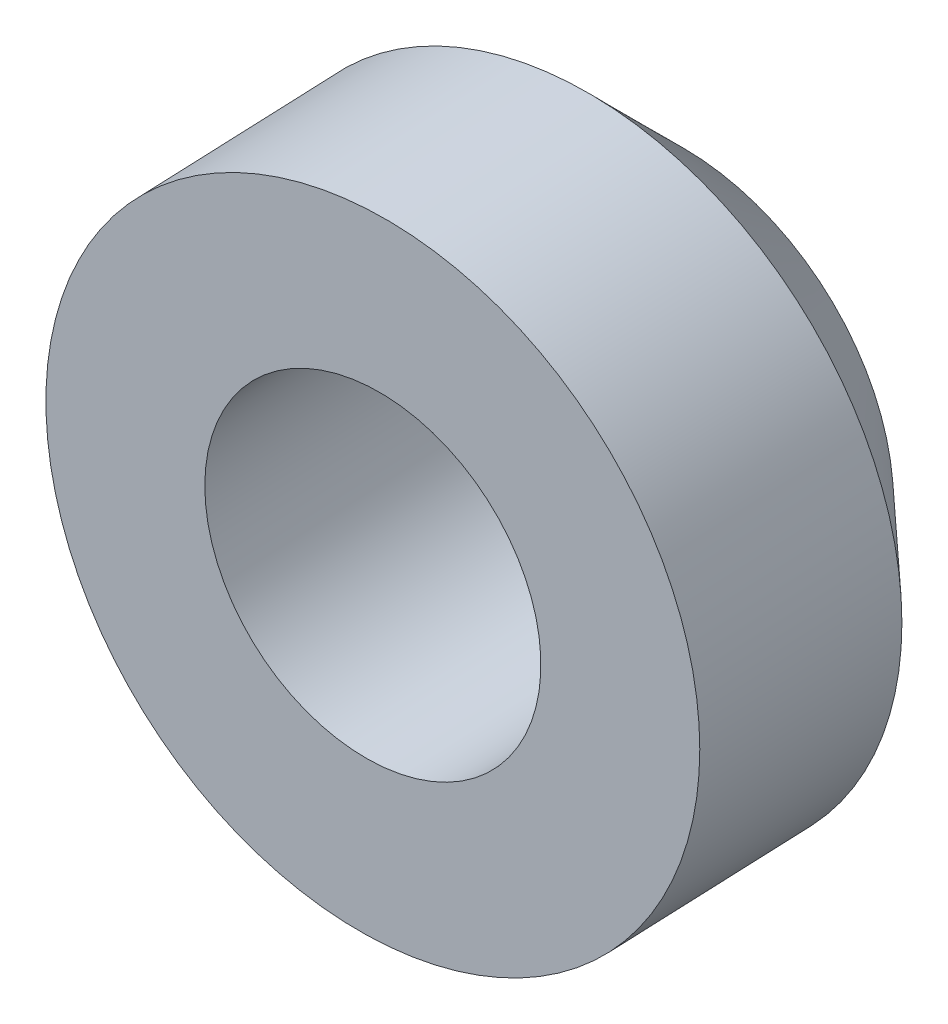
ISO-10303-21;
HEADER;
FILE_DESCRIPTION(('STEP AP214'),'2;1');
FILE_NAME('part.step','',(''),(''),'','','');
FILE_SCHEMA(('AUTOMOTIVE_DESIGN { 1 0 10303 214 1 1 1 1 }'));
ENDSEC;
DATA;
#1=APPLICATION_CONTEXT('core data for automotive mechanical design processes');
#2=APPLICATION_PROTOCOL_DEFINITION('international standard','automotive_design',2000,#1);
#3=PRODUCT_CONTEXT('',#1,'mechanical');
#4=PRODUCT('Part','Part','',(#3));
#5=PRODUCT_RELATED_PRODUCT_CATEGORY('part','',(#4));
#6=PRODUCT_DEFINITION_FORMATION('','',#4);
#7=PRODUCT_DEFINITION_CONTEXT('part definition',#1,'design');
#8=PRODUCT_DEFINITION('design','',#6,#7);
#9=PRODUCT_DEFINITION_SHAPE('','',#8);
#10=(LENGTH_UNIT() NAMED_UNIT(*) SI_UNIT(.MILLI.,.METRE.));
#11=(NAMED_UNIT(*) PLANE_ANGLE_UNIT() SI_UNIT($,.RADIAN.));
#12=(NAMED_UNIT(*) SI_UNIT($,.STERADIAN.) SOLID_ANGLE_UNIT());
#13=UNCERTAINTY_MEASURE_WITH_UNIT(LENGTH_MEASURE(1.E-05),#10,'distance_accuracy_value','');
#14=(GEOMETRIC_REPRESENTATION_CONTEXT(3) GLOBAL_UNCERTAINTY_ASSIGNED_CONTEXT((#13)) GLOBAL_UNIT_ASSIGNED_CONTEXT((#10,
#11,#12)) REPRESENTATION_CONTEXT('',''));
#15=CARTESIAN_POINT('',(0.,0.,0.));
#16=DIRECTION('',(0.,0.,1.));
#17=DIRECTION('',(1.,0.,0.));
#18=AXIS2_PLACEMENT_3D('',#15,#16,#17);
#19=CARTESIAN_POINT('',(1572.07876510956,482.6,302.44152541228));
#20=DIRECTION('',(0.040181732783339,0.,0.999192388056739));
#21=DIRECTION('',(0.999192388056739,0.,-0.040181732783339));
#22=AXIS2_PLACEMENT_3D('',#19,#20,#21);
#23=CYLINDRICAL_SURFACE('',#22,6.35000000000002);
#24=CARTESIAN_POINT('',(1572.07876510956,482.6,302.44152541228));
#25=DIRECTION('',(0.040181732783339,0.,0.999192388056739));
#26=DIRECTION('',(0.999192388056739,0.,-0.040181732783339));
#27=AXIS2_PLACEMENT_3D('',#24,#25,#26);
#28=CIRCLE('',#27,6.35000000000002);
#29=CARTESIAN_POINT('',(1578.42363677372,482.6,302.186371409106));
#30=VERTEX_POINT('',#29);
#31=EDGE_CURVE('E48',#30,#30,#28,.T.);
#32=ORIENTED_EDGE('',*,*,#31,.F.);
#33=EDGE_LOOP('',(#32));
#34=FACE_BOUND('',#33,.T.);
#35=CARTESIAN_POINT('',(1571.90781192743,482.6,298.190461397296));
#36=DIRECTION('',(0.040181732783339,0.,0.999192388056739));
#37=DIRECTION('',(0.999192388056739,0.,-0.040181732783339));
#38=AXIS2_PLACEMENT_3D('',#35,#36,#37);
#39=CIRCLE('',#38,6.35000000000002);
#40=CARTESIAN_POINT('',(1578.25268359159,482.6,297.935307394121));
#41=VERTEX_POINT('',#40);
#42=EDGE_CURVE('E10',#41,#41,#39,.T.);
#43=ORIENTED_EDGE('',*,*,#42,.T.);
#44=EDGE_LOOP('',(#43));
#45=FACE_BOUND('',#44,.T.);
#46=ADVANCED_FACE('F38',(#34,#45),#23,.T.);
#47=CARTESIAN_POINT('',(1571.82361110638,482.6,296.096653748123));
#48=DIRECTION('',(0.040181732783339,0.,0.999192388056739));
#49=DIRECTION('',(0.999192388056739,0.,-0.040181732783339));
#50=AXIS2_PLACEMENT_3D('',#47,#48,#49);
#51=CONICAL_SURFACE('',#50,4.25449999999999,0.785398163397444);
#52=ORIENTED_EDGE('',*,*,#42,.F.);
#53=EDGE_LOOP('',(#52));
#54=FACE_BOUND('',#53,.T.);
#55=CARTESIAN_POINT('',(1571.82361110638,482.6,296.096653748123));
#56=DIRECTION('',(0.040181732783339,0.,0.999192388056739));
#57=DIRECTION('',(0.999192388056739,0.,-0.040181732783339));
#58=AXIS2_PLACEMENT_3D('',#55,#56,#57);
#59=CIRCLE('',#58,4.25449999999999);
#60=CARTESIAN_POINT('',(1576.07467512137,482.6,295.925700565996));
#61=VERTEX_POINT('',#60);
#62=EDGE_CURVE('E44',#61,#61,#59,.T.);
#63=ORIENTED_EDGE('',*,*,#62,.T.);
#64=EDGE_LOOP('',(#63));
#65=FACE_BOUND('',#64,.T.);
#66=ADVANCED_FACE('F68',(#54,#65),#51,.T.);
#67=CARTESIAN_POINT('',(1571.82361110638,1.02421384976319E-11,296.096653748122));
#68=DIRECTION('',(0.040181732783339,0.,0.999192388056739));
#69=DIRECTION('',(0.999192388056739,0.,-0.040181732783339));
#70=AXIS2_PLACEMENT_3D('',#67,#68,#69);
#71=PLANE('',#70);
#72=CARTESIAN_POINT('',(1571.82361110638,482.6,296.096653748123));
#73=DIRECTION('',(-0.040181732783339,0.,-0.999192388056739));
#74=DIRECTION('',(-0.999192388056739,0.,0.040181732783339));
#75=AXIS2_PLACEMENT_3D('',#72,#73,#74);
#76=CIRCLE('',#75,3.26389999999999);
#77=CARTESIAN_POINT('',(1568.562347071,482.6,296.227802905754));
#78=VERTEX_POINT('',#77);
#79=EDGE_CURVE('E57',#78,#78,#76,.T.);
#80=ORIENTED_EDGE('',*,*,#79,.F.);
#81=EDGE_LOOP('',(#80));
#82=FACE_BOUND('',#81,.T.);
#83=ORIENTED_EDGE('',*,*,#62,.F.);
#84=EDGE_LOOP('',(#83));
#85=FACE_BOUND('',#84,.T.);
#86=ADVANCED_FACE('F64',(#82,#85),#71,.F.);
#87=CARTESIAN_POINT('',(1572.07876510956,1.02421384976319E-11,302.44152541228));
#88=DIRECTION('',(-0.040181732783339,0.,-0.999192388056739));
#89=DIRECTION('',(-0.999192388056739,0.,0.040181732783339));
#90=AXIS2_PLACEMENT_3D('',#87,#88,#89);
#91=PLANE('',#90);
#92=CARTESIAN_POINT('',(1572.07876510955,482.6,302.441525412281));
#93=DIRECTION('',(-0.040181732783339,0.,-0.999192388056739));
#94=DIRECTION('',(-0.999192388056739,0.,0.040181732783339));
#95=AXIS2_PLACEMENT_3D('',#92,#93,#94);
#96=CIRCLE('',#95,3.26389999999999);
#97=CARTESIAN_POINT('',(1568.81750107417,482.6,302.572674569912));
#98=VERTEX_POINT('',#97);
#99=EDGE_CURVE('E52',#98,#98,#96,.T.);
#100=ORIENTED_EDGE('',*,*,#99,.T.);
#101=EDGE_LOOP('',(#100));
#102=FACE_BOUND('',#101,.T.);
#103=ORIENTED_EDGE('',*,*,#31,.T.);
#104=EDGE_LOOP('',(#103));
#105=FACE_BOUND('',#104,.T.);
#106=ADVANCED_FACE('F67',(#102,#105),#91,.F.);
#107=CARTESIAN_POINT('',(1571.82361110638,482.6,296.096653748123));
#108=DIRECTION('',(-0.040181732783339,0.,-0.999192388056739));
#109=DIRECTION('',(-0.999192388056739,0.,0.040181732783339));
#110=AXIS2_PLACEMENT_3D('',#107,#108,#109);
#111=CYLINDRICAL_SURFACE('',#110,3.26389999999999);
#112=ORIENTED_EDGE('',*,*,#79,.T.);
#113=EDGE_LOOP('',(#112));
#114=FACE_BOUND('',#113,.T.);
#115=ORIENTED_EDGE('',*,*,#99,.F.);
#116=EDGE_LOOP('',(#115));
#117=FACE_BOUND('',#116,.T.);
#118=ADVANCED_FACE('F61',(#114,#117),#111,.F.);
#119=CLOSED_SHELL('',(#46,#66,#86,#106,#118));
#120=MANIFOLD_SOLID_BREP('B2',#119);
#121=ADVANCED_BREP_SHAPE_REPRESENTATION('',(#18,#120),#14);
#122=SHAPE_DEFINITION_REPRESENTATION(#9,#121);
ENDSEC;
END-ISO-10303-21;
